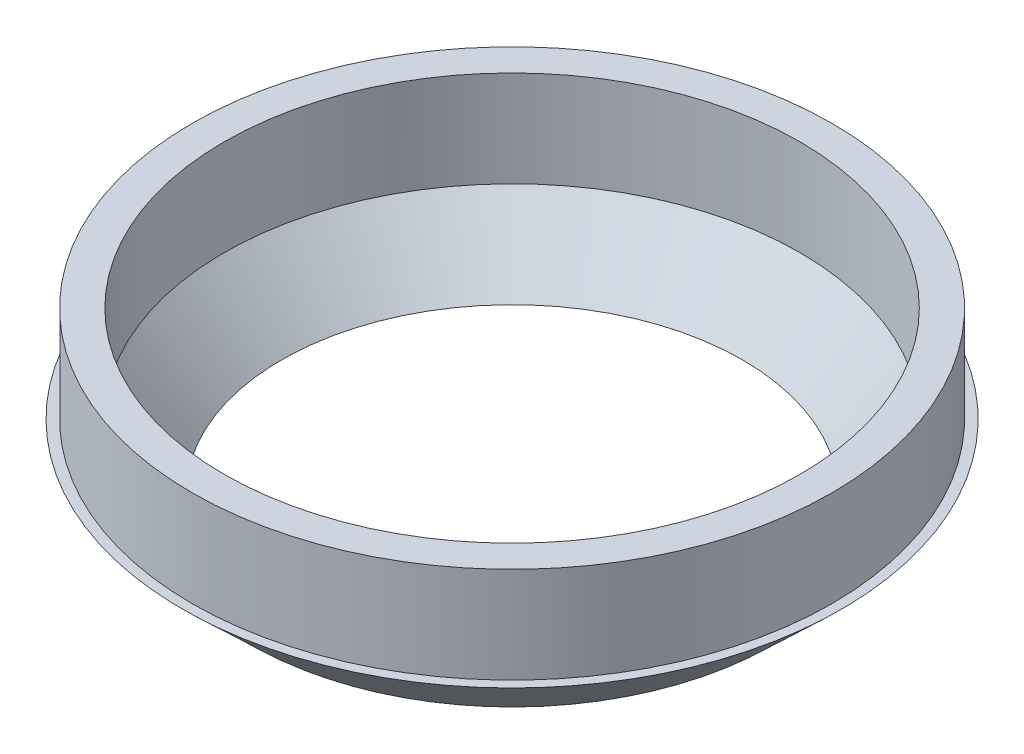
ISO-10303-21;
HEADER;
FILE_DESCRIPTION(('STEP AP214'),'2;1');
FILE_NAME('part.step','',(''),(''),'','','');
FILE_SCHEMA(('AUTOMOTIVE_DESIGN { 1 0 10303 214 1 1 1 1 }'));
ENDSEC;
DATA;
#1=APPLICATION_CONTEXT('core data for automotive mechanical design processes');
#2=APPLICATION_PROTOCOL_DEFINITION('international standard','automotive_design',2000,#1);
#3=PRODUCT_CONTEXT('',#1,'mechanical');
#4=PRODUCT('Part','Part','',(#3));
#5=PRODUCT_RELATED_PRODUCT_CATEGORY('part','',(#4));
#6=PRODUCT_DEFINITION_FORMATION('','',#4);
#7=PRODUCT_DEFINITION_CONTEXT('part definition',#1,'design');
#8=PRODUCT_DEFINITION('design','',#6,#7);
#9=PRODUCT_DEFINITION_SHAPE('','',#8);
#10=(LENGTH_UNIT() NAMED_UNIT(*) SI_UNIT(.MILLI.,.METRE.));
#11=(NAMED_UNIT(*) PLANE_ANGLE_UNIT() SI_UNIT($,.RADIAN.));
#12=(NAMED_UNIT(*) SI_UNIT($,.STERADIAN.) SOLID_ANGLE_UNIT());
#13=UNCERTAINTY_MEASURE_WITH_UNIT(LENGTH_MEASURE(1.E-05),#10,'distance_accuracy_value','');
#14=(GEOMETRIC_REPRESENTATION_CONTEXT(3) GLOBAL_UNCERTAINTY_ASSIGNED_CONTEXT((#13)) GLOBAL_UNIT_ASSIGNED_CONTEXT((#10,
#11,#12)) REPRESENTATION_CONTEXT('',''));
#15=CARTESIAN_POINT('',(0.,0.,0.));
#16=DIRECTION('',(0.,0.,1.));
#17=DIRECTION('',(1.,0.,0.));
#18=AXIS2_PLACEMENT_3D('',#15,#16,#17);
#19=CARTESIAN_POINT('',(0.,0.,0.));
#20=DIRECTION('',(0.,1.,0.));
#21=DIRECTION('',(0.,0.,1.));
#22=AXIS2_PLACEMENT_3D('',#19,#20,#21);
#23=CONICAL_SURFACE('',#22,45.72,0.732815101786507);
#24=CARTESIAN_POINT('',(0.,12.7,0.));
#25=DIRECTION('',(0.,-1.,0.));
#26=DIRECTION('',(0.,0.,-1.));
#27=AXIS2_PLACEMENT_3D('',#24,#25,#26);
#28=CIRCLE('',#27,57.15);
#29=CARTESIAN_POINT('',(0.,12.7,-57.15));
#30=VERTEX_POINT('',#29);
#31=EDGE_CURVE('E51',#30,#30,#28,.T.);
#32=ORIENTED_EDGE('',*,*,#31,.F.);
#33=EDGE_LOOP('',(#32));
#34=FACE_BOUND('',#33,.T.);
#35=CARTESIAN_POINT('',(0.,0.,0.));
#36=DIRECTION('',(0.,-1.,0.));
#37=DIRECTION('',(0.,0.,-1.));
#38=AXIS2_PLACEMENT_3D('',#35,#36,#37);
#39=CIRCLE('',#38,45.72);
#40=CARTESIAN_POINT('',(0.,0.,-45.72));
#41=VERTEX_POINT('',#40);
#42=EDGE_CURVE('E38',#41,#41,#39,.T.);
#43=ORIENTED_EDGE('',*,*,#42,.T.);
#44=EDGE_LOOP('',(#43));
#45=FACE_BOUND('',#44,.T.);
#46=ADVANCED_FACE('F35',(#34,#45),#23,.F.);
#47=CARTESIAN_POINT('',(-45.72,0.,0.));
#48=DIRECTION('',(0.,1.,0.));
#49=DIRECTION('',(0.,0.,1.));
#50=AXIS2_PLACEMENT_3D('',#47,#48,#49);
#51=PLANE('',#50);
#52=ORIENTED_EDGE('',*,*,#42,.F.);
#53=EDGE_LOOP('',(#52));
#54=FACE_BOUND('',#53,.T.);
#55=CARTESIAN_POINT('',(0.,0.,0.));
#56=DIRECTION('',(0.,-1.,0.));
#57=DIRECTION('',(0.,0.,-1.));
#58=AXIS2_PLACEMENT_3D('',#55,#56,#57);
#59=CIRCLE('',#58,52.07);
#60=CARTESIAN_POINT('',(0.,0.,-52.07));
#61=VERTEX_POINT('',#60);
#62=EDGE_CURVE('E46',#61,#61,#59,.T.);
#63=ORIENTED_EDGE('',*,*,#62,.T.);
#64=EDGE_LOOP('',(#63));
#65=FACE_BOUND('',#64,.T.);
#66=ADVANCED_FACE('F59',(#54,#65),#51,.F.);
#67=CARTESIAN_POINT('',(0.,12.7,0.));
#68=DIRECTION('',(0.,1.,0.));
#69=DIRECTION('',(0.,0.,1.));
#70=AXIS2_PLACEMENT_3D('',#67,#68,#69);
#71=CONICAL_SURFACE('',#70,65.405,0.809783572570167);
#72=ORIENTED_EDGE('',*,*,#62,.F.);
#73=EDGE_LOOP('',(#72));
#74=FACE_BOUND('',#73,.T.);
#75=CARTESIAN_POINT('',(0.,12.7,0.));
#76=DIRECTION('',(0.,-1.,0.));
#77=DIRECTION('',(0.,0.,-1.));
#78=AXIS2_PLACEMENT_3D('',#75,#76,#77);
#79=CIRCLE('',#78,65.405);
#80=CARTESIAN_POINT('',(0.,12.7,-65.405));
#81=VERTEX_POINT('',#80);
#82=EDGE_CURVE('E54',#81,#81,#79,.T.);
#83=ORIENTED_EDGE('',*,*,#82,.T.);
#84=EDGE_LOOP('',(#83));
#85=FACE_BOUND('',#84,.T.);
#86=ADVANCED_FACE('F61',(#74,#85),#71,.T.);
#87=CARTESIAN_POINT('',(-57.15,12.7,0.));
#88=DIRECTION('',(0.,-1.,0.));
#89=DIRECTION('',(0.,0.,-1.));
#90=AXIS2_PLACEMENT_3D('',#87,#88,#89);
#91=PLANE('',#90);
#92=CARTESIAN_POINT('',(0.,12.7,0.));
#93=DIRECTION('',(0.,1.,0.));
#94=DIRECTION('',(0.,0.,1.));
#95=AXIS2_PLACEMENT_3D('',#92,#93,#94);
#96=CIRCLE('',#95,63.5);
#97=CARTESIAN_POINT('',(0.,12.7,63.5));
#98=VERTEX_POINT('',#97);
#99=EDGE_CURVE('E10',#98,#98,#96,.T.);
#100=ORIENTED_EDGE('',*,*,#99,.F.);
#101=EDGE_LOOP('',(#100));
#102=FACE_BOUND('',#101,.T.);
#103=ORIENTED_EDGE('',*,*,#82,.F.);
#104=EDGE_LOOP('',(#103));
#105=FACE_BOUND('',#104,.T.);
#106=ADVANCED_FACE('F64',(#102,#105),#91,.F.);
#107=CARTESIAN_POINT('',(0.,31.75,0.));
#108=DIRECTION('',(0.,1.,0.));
#109=DIRECTION('',(0.,0.,1.));
#110=AXIS2_PLACEMENT_3D('',#107,#108,#109);
#111=PLANE('',#110);
#112=CARTESIAN_POINT('',(0.,31.75,0.));
#113=DIRECTION('',(0.,1.,0.));
#114=DIRECTION('',(0.,0.,1.));
#115=AXIS2_PLACEMENT_3D('',#112,#113,#114);
#116=CIRCLE('',#115,63.5);
#117=CARTESIAN_POINT('',(0.,31.75,63.5));
#118=VERTEX_POINT('',#117);
#119=EDGE_CURVE('E49',#118,#118,#116,.T.);
#120=ORIENTED_EDGE('',*,*,#119,.T.);
#121=EDGE_LOOP('',(#120));
#122=FACE_BOUND('',#121,.T.);
#123=CARTESIAN_POINT('',(0.,31.75,0.));
#124=DIRECTION('',(0.,1.,0.));
#125=DIRECTION('',(0.,0.,1.));
#126=AXIS2_PLACEMENT_3D('',#123,#124,#125);
#127=CIRCLE('',#126,57.15);
#128=CARTESIAN_POINT('',(0.,31.75,57.15));
#129=VERTEX_POINT('',#128);
#130=EDGE_CURVE('E99',#129,#129,#127,.T.);
#131=ORIENTED_EDGE('',*,*,#130,.F.);
#132=EDGE_LOOP('',(#131));
#133=FACE_BOUND('',#132,.T.);
#134=ADVANCED_FACE('F69',(#122,#133),#111,.T.);
#135=CARTESIAN_POINT('',(0.,31.75,0.));
#136=DIRECTION('',(0.,-1.,0.));
#137=DIRECTION('',(0.,0.,-1.));
#138=AXIS2_PLACEMENT_3D('',#135,#136,#137);
#139=CYLINDRICAL_SURFACE('',#138,63.5);
#140=ORIENTED_EDGE('',*,*,#119,.F.);
#141=EDGE_LOOP('',(#140));
#142=FACE_BOUND('',#141,.T.);
#143=ORIENTED_EDGE('',*,*,#99,.T.);
#144=EDGE_LOOP('',(#143));
#145=FACE_BOUND('',#144,.T.);
#146=ADVANCED_FACE('F75',(#142,#145),#139,.T.);
#147=CARTESIAN_POINT('',(0.,31.75,0.));
#148=DIRECTION('',(0.,-1.,0.));
#149=DIRECTION('',(0.,0.,-1.));
#150=AXIS2_PLACEMENT_3D('',#147,#148,#149);
#151=CYLINDRICAL_SURFACE('',#150,57.15);
#152=ORIENTED_EDGE('',*,*,#130,.T.);
#153=EDGE_LOOP('',(#152));
#154=FACE_BOUND('',#153,.T.);
#155=ORIENTED_EDGE('',*,*,#31,.T.);
#156=EDGE_LOOP('',(#155));
#157=FACE_BOUND('',#156,.T.);
#158=ADVANCED_FACE('F89',(#154,#157),#151,.F.);
#159=CLOSED_SHELL('',(#46,#66,#86,#106,#134,#146,#158));
#160=MANIFOLD_SOLID_BREP('B2',#159);
#161=ADVANCED_BREP_SHAPE_REPRESENTATION('',(#18,#160),#14);
#162=SHAPE_DEFINITION_REPRESENTATION(#9,#161);
ENDSEC;
END-ISO-10303-21;
